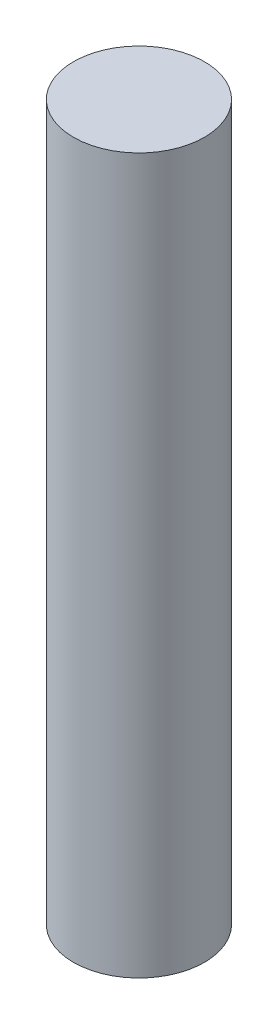
ISO-10303-21;
HEADER;
FILE_DESCRIPTION(('STEP AP214'),'2;1');
FILE_NAME('part.step','',(''),(''),'','','');
FILE_SCHEMA(('AUTOMOTIVE_DESIGN { 1 0 10303 214 1 1 1 1 }'));
ENDSEC;
DATA;
#1=APPLICATION_CONTEXT('core data for automotive mechanical design processes');
#2=APPLICATION_PROTOCOL_DEFINITION('international standard','automotive_design',2000,#1);
#3=PRODUCT_CONTEXT('',#1,'mechanical');
#4=PRODUCT('Part','Part','',(#3));
#5=PRODUCT_RELATED_PRODUCT_CATEGORY('part','',(#4));
#6=PRODUCT_DEFINITION_FORMATION('','',#4);
#7=PRODUCT_DEFINITION_CONTEXT('part definition',#1,'design');
#8=PRODUCT_DEFINITION('design','',#6,#7);
#9=PRODUCT_DEFINITION_SHAPE('','',#8);
#10=(LENGTH_UNIT() NAMED_UNIT(*) SI_UNIT(.MILLI.,.METRE.));
#11=(NAMED_UNIT(*) PLANE_ANGLE_UNIT() SI_UNIT($,.RADIAN.));
#12=(NAMED_UNIT(*) SI_UNIT($,.STERADIAN.) SOLID_ANGLE_UNIT());
#13=UNCERTAINTY_MEASURE_WITH_UNIT(LENGTH_MEASURE(1.E-05),#10,'distance_accuracy_value','');
#14=(GEOMETRIC_REPRESENTATION_CONTEXT(3) GLOBAL_UNCERTAINTY_ASSIGNED_CONTEXT((#13)) GLOBAL_UNIT_ASSIGNED_CONTEXT((#10,
#11,#12)) REPRESENTATION_CONTEXT('',''));
#15=CARTESIAN_POINT('',(0.,0.,0.));
#16=DIRECTION('',(0.,0.,1.));
#17=DIRECTION('',(1.,0.,0.));
#18=AXIS2_PLACEMENT_3D('',#15,#16,#17);
#19=CARTESIAN_POINT('',(0.,60.,0.));
#20=DIRECTION('',(0.,-1.,0.));
#21=DIRECTION('',(0.,0.,-1.));
#22=AXIS2_PLACEMENT_3D('',#19,#20,#21);
#23=CYLINDRICAL_SURFACE('',#22,5.5);
#24=CARTESIAN_POINT('',(0.,60.,0.));
#25=DIRECTION('',(0.,1.,0.));
#26=DIRECTION('',(0.,0.,1.));
#27=AXIS2_PLACEMENT_3D('',#24,#25,#26);
#28=CIRCLE('',#27,5.5);
#29=CARTESIAN_POINT('',(0.,60.,5.5));
#30=VERTEX_POINT('',#29);
#31=EDGE_CURVE('E10',#30,#30,#28,.T.);
#32=ORIENTED_EDGE('',*,*,#31,.F.);
#33=EDGE_LOOP('',(#32));
#34=FACE_BOUND('',#33,.T.);
#35=CARTESIAN_POINT('',(0.,0.,0.));
#36=DIRECTION('',(0.,1.,0.));
#37=DIRECTION('',(0.,0.,1.));
#38=AXIS2_PLACEMENT_3D('',#35,#36,#37);
#39=CIRCLE('',#38,5.5);
#40=CARTESIAN_POINT('',(0.,0.,5.5));
#41=VERTEX_POINT('',#40);
#42=EDGE_CURVE('E31',#41,#41,#39,.T.);
#43=ORIENTED_EDGE('',*,*,#42,.T.);
#44=EDGE_LOOP('',(#43));
#45=FACE_BOUND('',#44,.T.);
#46=ADVANCED_FACE('F28',(#34,#45),#23,.T.);
#47=CARTESIAN_POINT('',(0.,60.,0.));
#48=DIRECTION('',(0.,1.,0.));
#49=DIRECTION('',(0.,0.,1.));
#50=AXIS2_PLACEMENT_3D('',#47,#48,#49);
#51=PLANE('',#50);
#52=ORIENTED_EDGE('',*,*,#31,.T.);
#53=EDGE_LOOP('',(#52));
#54=FACE_BOUND('',#53,.T.);
#55=ADVANCED_FACE('F43',(#54),#51,.T.);
#56=CARTESIAN_POINT('',(0.,0.,0.));
#57=DIRECTION('',(0.,1.,0.));
#58=DIRECTION('',(0.,0.,1.));
#59=AXIS2_PLACEMENT_3D('',#56,#57,#58);
#60=PLANE('',#59);
#61=ORIENTED_EDGE('',*,*,#42,.F.);
#62=EDGE_LOOP('',(#61));
#63=FACE_BOUND('',#62,.T.);
#64=ADVANCED_FACE('F41',(#63),#60,.F.);
#65=CLOSED_SHELL('',(#46,#55,#64));
#66=MANIFOLD_SOLID_BREP('B2',#65);
#67=ADVANCED_BREP_SHAPE_REPRESENTATION('',(#18,#66),#14);
#68=SHAPE_DEFINITION_REPRESENTATION(#9,#67);
ENDSEC;
END-ISO-10303-21;
